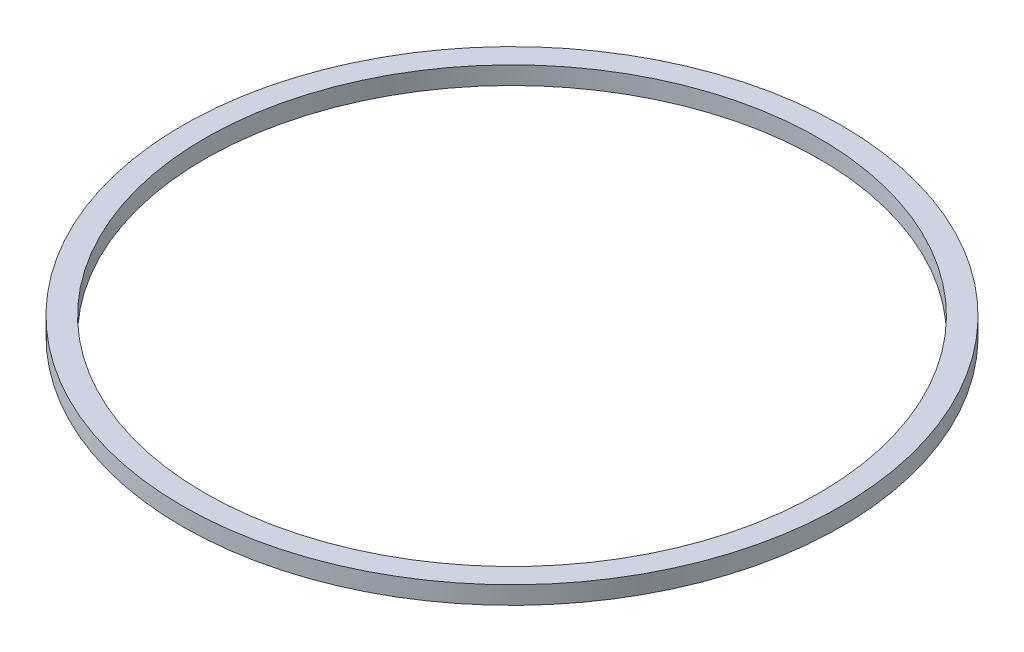
ISO-10303-21;
HEADER;
FILE_DESCRIPTION(('STEP AP214'),'2;1');
FILE_NAME('part.step','',(''),(''),'','','');
FILE_SCHEMA(('AUTOMOTIVE_DESIGN { 1 0 10303 214 1 1 1 1 }'));
ENDSEC;
DATA;
#1=APPLICATION_CONTEXT('core data for automotive mechanical design processes');
#2=APPLICATION_PROTOCOL_DEFINITION('international standard','automotive_design',2000,#1);
#3=PRODUCT_CONTEXT('',#1,'mechanical');
#4=PRODUCT('Part','Part','',(#3));
#5=PRODUCT_RELATED_PRODUCT_CATEGORY('part','',(#4));
#6=PRODUCT_DEFINITION_FORMATION('','',#4);
#7=PRODUCT_DEFINITION_CONTEXT('part definition',#1,'design');
#8=PRODUCT_DEFINITION('design','',#6,#7);
#9=PRODUCT_DEFINITION_SHAPE('','',#8);
#10=(LENGTH_UNIT() NAMED_UNIT(*) SI_UNIT(.MILLI.,.METRE.));
#11=(NAMED_UNIT(*) PLANE_ANGLE_UNIT() SI_UNIT($,.RADIAN.));
#12=(NAMED_UNIT(*) SI_UNIT($,.STERADIAN.) SOLID_ANGLE_UNIT());
#13=UNCERTAINTY_MEASURE_WITH_UNIT(LENGTH_MEASURE(1.E-05),#10,'distance_accuracy_value','');
#14=(GEOMETRIC_REPRESENTATION_CONTEXT(3) GLOBAL_UNCERTAINTY_ASSIGNED_CONTEXT((#13)) GLOBAL_UNIT_ASSIGNED_CONTEXT((#10,
#11,#12)) REPRESENTATION_CONTEXT('',''));
#15=CARTESIAN_POINT('',(0.,0.,0.));
#16=DIRECTION('',(0.,0.,1.));
#17=DIRECTION('',(1.,0.,0.));
#18=AXIS2_PLACEMENT_3D('',#15,#16,#17);
#19=CARTESIAN_POINT('',(0.,4.,0.));
#20=DIRECTION('',(0.,-1.,0.));
#21=DIRECTION('',(0.,0.,-1.));
#22=AXIS2_PLACEMENT_3D('',#19,#20,#21);
#23=CYLINDRICAL_SURFACE('',#22,73.75);
#24=CARTESIAN_POINT('',(0.,4.,0.));
#25=DIRECTION('',(0.,1.,0.));
#26=DIRECTION('',(0.,0.,1.));
#27=AXIS2_PLACEMENT_3D('',#24,#25,#26);
#28=CIRCLE('',#27,73.75);
#29=CARTESIAN_POINT('',(0.,4.,73.75));
#30=VERTEX_POINT('',#29);
#31=EDGE_CURVE('E10',#30,#30,#28,.T.);
#32=ORIENTED_EDGE('',*,*,#31,.F.);
#33=EDGE_LOOP('',(#32));
#34=FACE_BOUND('',#33,.T.);
#35=CARTESIAN_POINT('',(0.,0.,0.));
#36=DIRECTION('',(0.,1.,0.));
#37=DIRECTION('',(0.,0.,1.));
#38=AXIS2_PLACEMENT_3D('',#35,#36,#37);
#39=CIRCLE('',#38,73.75);
#40=CARTESIAN_POINT('',(0.,0.,73.75));
#41=VERTEX_POINT('',#40);
#42=EDGE_CURVE('E45',#41,#41,#39,.T.);
#43=ORIENTED_EDGE('',*,*,#42,.T.);
#44=EDGE_LOOP('',(#43));
#45=FACE_BOUND('',#44,.T.);
#46=ADVANCED_FACE('F37',(#34,#45),#23,.T.);
#47=CARTESIAN_POINT('',(0.,4.,0.));
#48=DIRECTION('',(0.,1.,0.));
#49=DIRECTION('',(0.,0.,1.));
#50=AXIS2_PLACEMENT_3D('',#47,#48,#49);
#51=PLANE('',#50);
#52=CARTESIAN_POINT('',(0.,4.,0.));
#53=DIRECTION('',(0.,1.,0.));
#54=DIRECTION('',(0.,0.,1.));
#55=AXIS2_PLACEMENT_3D('',#52,#53,#54);
#56=CIRCLE('',#55,68.75);
#57=CARTESIAN_POINT('',(0.,4.,68.75));
#58=VERTEX_POINT('',#57);
#59=EDGE_CURVE('E52',#58,#58,#56,.T.);
#60=ORIENTED_EDGE('',*,*,#59,.F.);
#61=EDGE_LOOP('',(#60));
#62=FACE_BOUND('',#61,.T.);
#63=ORIENTED_EDGE('',*,*,#31,.T.);
#64=EDGE_LOOP('',(#63));
#65=FACE_BOUND('',#64,.T.);
#66=ADVANCED_FACE('F70',(#62,#65),#51,.T.);
#67=CARTESIAN_POINT('',(0.,0.,0.));
#68=DIRECTION('',(0.,1.,0.));
#69=DIRECTION('',(0.,0.,1.));
#70=AXIS2_PLACEMENT_3D('',#67,#68,#69);
#71=PLANE('',#70);
#72=CARTESIAN_POINT('',(0.,0.,0.));
#73=DIRECTION('',(0.,1.,0.));
#74=DIRECTION('',(0.,0.,1.));
#75=AXIS2_PLACEMENT_3D('',#72,#73,#74);
#76=CIRCLE('',#75,68.75);
#77=CARTESIAN_POINT('',(0.,0.,68.75));
#78=VERTEX_POINT('',#77);
#79=EDGE_CURVE('E40',#78,#78,#76,.T.);
#80=ORIENTED_EDGE('',*,*,#79,.T.);
#81=EDGE_LOOP('',(#80));
#82=FACE_BOUND('',#81,.T.);
#83=ORIENTED_EDGE('',*,*,#42,.F.);
#84=EDGE_LOOP('',(#83));
#85=FACE_BOUND('',#84,.T.);
#86=ADVANCED_FACE('F61',(#82,#85),#71,.F.);
#87=CARTESIAN_POINT('',(0.,-66.,0.));
#88=DIRECTION('',(0.,1.,0.));
#89=DIRECTION('',(0.,0.,1.));
#90=AXIS2_PLACEMENT_3D('',#87,#88,#89);
#91=CYLINDRICAL_SURFACE('',#90,68.75);
#92=ORIENTED_EDGE('',*,*,#59,.T.);
#93=EDGE_LOOP('',(#92));
#94=FACE_BOUND('',#93,.T.);
#95=ORIENTED_EDGE('',*,*,#79,.F.);
#96=EDGE_LOOP('',(#95));
#97=FACE_BOUND('',#96,.T.);
#98=ADVANCED_FACE('F64',(#94,#97),#91,.F.);
#99=CLOSED_SHELL('',(#46,#66,#86,#98));
#100=MANIFOLD_SOLID_BREP('B2',#99);
#101=ADVANCED_BREP_SHAPE_REPRESENTATION('',(#18,#100),#14);
#102=SHAPE_DEFINITION_REPRESENTATION(#9,#101);
ENDSEC;
END-ISO-10303-21;
